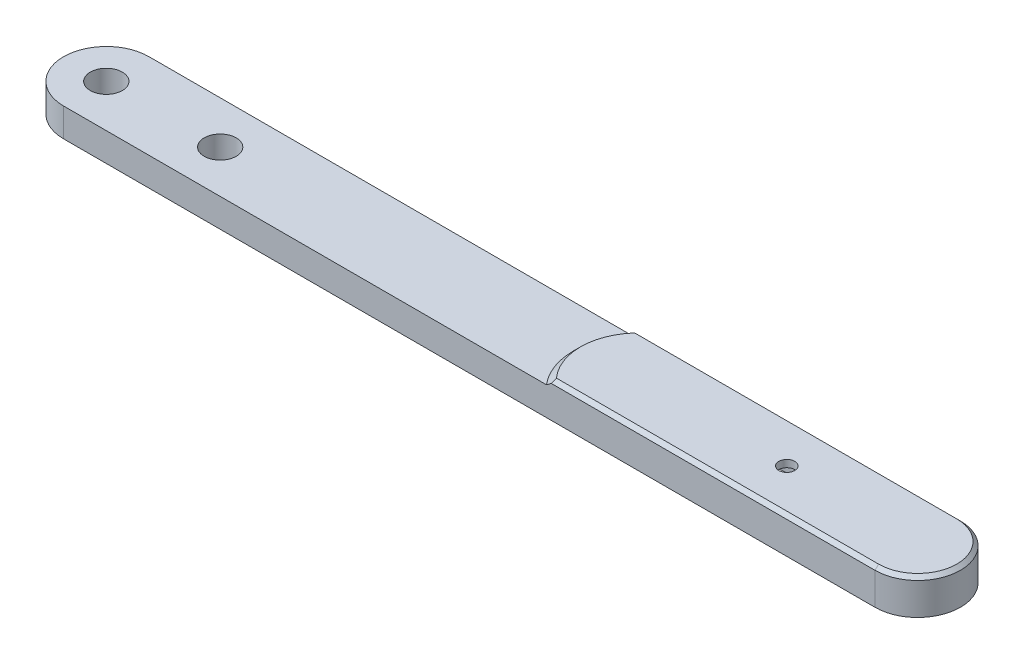
ISO-10303-21;
HEADER;
FILE_DESCRIPTION(('STEP AP214'),'2;1');
FILE_NAME('part.step','',(''),(''),'','','');
FILE_SCHEMA(('AUTOMOTIVE_DESIGN { 1 0 10303 214 1 1 1 1 }'));
ENDSEC;
DATA;
#1=APPLICATION_CONTEXT('core data for automotive mechanical design processes');
#2=APPLICATION_PROTOCOL_DEFINITION('international standard','automotive_design',2000,#1);
#3=PRODUCT_CONTEXT('',#1,'mechanical');
#4=PRODUCT('Part','Part','',(#3));
#5=PRODUCT_RELATED_PRODUCT_CATEGORY('part','',(#4));
#6=PRODUCT_DEFINITION_FORMATION('','',#4);
#7=PRODUCT_DEFINITION_CONTEXT('part definition',#1,'design');
#8=PRODUCT_DEFINITION('design','',#6,#7);
#9=PRODUCT_DEFINITION_SHAPE('','',#8);
#10=(LENGTH_UNIT() NAMED_UNIT(*) SI_UNIT(.MILLI.,.METRE.));
#11=(NAMED_UNIT(*) PLANE_ANGLE_UNIT() SI_UNIT($,.RADIAN.));
#12=(NAMED_UNIT(*) SI_UNIT($,.STERADIAN.) SOLID_ANGLE_UNIT());
#13=UNCERTAINTY_MEASURE_WITH_UNIT(LENGTH_MEASURE(1.E-05),#10,'distance_accuracy_value','');
#14=(GEOMETRIC_REPRESENTATION_CONTEXT(3) GLOBAL_UNCERTAINTY_ASSIGNED_CONTEXT((#13)) GLOBAL_UNIT_ASSIGNED_CONTEXT((#10,
#11,#12)) REPRESENTATION_CONTEXT('',''));
#15=CARTESIAN_POINT('',(0.,0.,0.));
#16=DIRECTION('',(0.,0.,1.));
#17=DIRECTION('',(1.,0.,0.));
#18=AXIS2_PLACEMENT_3D('',#15,#16,#17);
#19=CARTESIAN_POINT('',(-69.98462472,11.095,-5.9));
#20=DIRECTION('',(0.,1.,0.));
#21=DIRECTION('',(0.,0.,1.));
#22=AXIS2_PLACEMENT_3D('',#19,#20,#21);
#23=CYLINDRICAL_SURFACE('',#22,4.7625);
#24=CARTESIAN_POINT('',(-69.98462472,14.27,-5.9));
#25=DIRECTION('',(0.,1.,0.));
#26=DIRECTION('',(0.,0.,1.));
#27=AXIS2_PLACEMENT_3D('',#24,#25,#26);
#28=CIRCLE('',#27,4.7625);
#29=CARTESIAN_POINT('',(-69.98462472,14.27,-10.6625));
#30=VERTEX_POINT('',#29);
#31=CARTESIAN_POINT('',(-69.98462472,14.27,-1.1375));
#32=VERTEX_POINT('',#31);
#33=EDGE_CURVE('E195',#30,#32,#28,.T.);
#34=ORIENTED_EDGE('',*,*,#33,.F.);
#35=DIRECTION('',(0.,1.,0.));
#36=VECTOR('',#35,1.);
#37=CARTESIAN_POINT('',(-69.98462472,11.095,-10.6625));
#38=LINE('',#37,#36);
#39=CARTESIAN_POINT('',(-69.98462472,11.095,-10.6625));
#40=VERTEX_POINT('',#39);
#41=EDGE_CURVE('E213',#40,#30,#38,.T.);
#42=ORIENTED_EDGE('',*,*,#41,.F.);
#43=CARTESIAN_POINT('',(-69.98462472,11.095,-5.9));
#44=DIRECTION('',(0.,1.,0.));
#45=DIRECTION('',(0.,0.,1.));
#46=AXIS2_PLACEMENT_3D('',#43,#44,#45);
#47=CIRCLE('',#46,4.7625);
#48=CARTESIAN_POINT('',(-69.98462472,11.095,-1.1375));
#49=VERTEX_POINT('',#48);
#50=EDGE_CURVE('E181',#40,#49,#47,.T.);
#51=ORIENTED_EDGE('',*,*,#50,.T.);
#52=DIRECTION('',(0.,1.,0.));
#53=VECTOR('',#52,1.);
#54=CARTESIAN_POINT('',(-69.98462472,11.095,-1.1375));
#55=LINE('',#54,#53);
#56=EDGE_CURVE('E194',#49,#32,#55,.T.);
#57=ORIENTED_EDGE('',*,*,#56,.T.);
#58=EDGE_LOOP('',(#34,#42,#51,#57));
#59=FACE_BOUND('',#58,.T.);
#60=ADVANCED_FACE('F32',(#59),#23,.T.);
#61=CARTESIAN_POINT('',(20.5,11.095,-10.6625));
#62=DIRECTION('',(0.,0.,-1.));
#63=DIRECTION('',(-1.,0.,0.));
#64=AXIS2_PLACEMENT_3D('',#61,#62,#63);
#65=PLANE('',#64);
#66=CARTESIAN_POINT('',(-16.1358016582967,14.27,-10.6625));
#67=CARTESIAN_POINT('',(-16.0450029038725,14.3388277477596,-10.6625));
#68=CARTESIAN_POINT('',(-15.9538599768672,14.4072041000675,-10.6625));
#69=CARTESIAN_POINT('',(-15.7708252611896,14.5429156845768,-10.6625));
#70=CARTESIAN_POINT('',(-15.6789335948947,14.6102510819034,-10.6625));
#71=CARTESIAN_POINT('',(-15.494309265144,14.7437664242642,-10.6625));
#72=CARTESIAN_POINT('',(-15.4015765784473,14.809946337219,-10.6625));
#73=CARTESIAN_POINT('',(-15.2151695542577,14.9409977912461,-10.6625));
#74=CARTESIAN_POINT('',(-15.121495068085,15.0058691207168,-10.6625));
#75=CARTESIAN_POINT('',(-15.0273129548294,15.07,-10.6625));
#76=B_SPLINE_CURVE_WITH_KNOTS('',3,(#66,#67,#68,#69,#70,#71,#72,#73,#74,#75),.UNSPECIFIED.,.F.,
.F.,(4,2,2,2,4),(0.,0.341812299406749,0.683569809434601,1.02533679259764,1.36715860448552),.UNSPECIFIED.);
#77=CARTESIAN_POINT('',(-16.1358016582967,14.27,-10.6625));
#78=VERTEX_POINT('',#77);
#79=CARTESIAN_POINT('',(-15.5963086373971,14.6699999999907,-10.6625));
#80=VERTEX_POINT('',#79);
#81=EDGE_CURVE('E223',#78,#80,#76,.T.);
#82=ORIENTED_EDGE('',*,*,#81,.T.);
#83=DIRECTION('',(1.,0.,0.));
#84=VECTOR('',#83,1.);
#85=CARTESIAN_POINT('',(20.5,14.67,-10.6625));
#86=LINE('',#85,#84);
#87=CARTESIAN_POINT('',(20.5,14.67,-10.6625));
#88=VERTEX_POINT('',#87);
#89=EDGE_CURVE('E57',#80,#88,#86,.T.);
#90=ORIENTED_EDGE('',*,*,#89,.T.);
#91=DIRECTION('',(0.,1.,0.));
#92=VECTOR('',#91,1.);
#93=CARTESIAN_POINT('',(20.5,11.095,-10.6625));
#94=LINE('',#93,#92);
#95=CARTESIAN_POINT('',(20.5,11.095,-10.6625));
#96=VERTEX_POINT('',#95);
#97=EDGE_CURVE('E255',#96,#88,#94,.T.);
#98=ORIENTED_EDGE('',*,*,#97,.F.);
#99=DIRECTION('',(-1.,0.,0.));
#100=VECTOR('',#99,1.);
#101=CARTESIAN_POINT('',(20.5,11.095,-10.6625));
#102=LINE('',#101,#100);
#103=EDGE_CURVE('E191',#96,#40,#102,.T.);
#104=ORIENTED_EDGE('',*,*,#103,.T.);
#105=ORIENTED_EDGE('',*,*,#41,.T.);
#106=DIRECTION('',(-1.,0.,0.));
#107=VECTOR('',#106,1.);
#108=CARTESIAN_POINT('',(20.5,14.27,-10.6625));
#109=LINE('',#108,#107);
#110=EDGE_CURVE('E185',#78,#30,#109,.T.);
#111=ORIENTED_EDGE('',*,*,#110,.F.);
#112=EDGE_LOOP('',(#82,#90,#98,#104,#105,#111));
#113=FACE_BOUND('',#112,.T.);
#114=ADVANCED_FACE('F241',(#113),#65,.T.);
#115=CARTESIAN_POINT('',(20.5,11.095,-5.9));
#116=DIRECTION('',(0.,1.,0.));
#117=DIRECTION('',(0.,0.,1.));
#118=AXIS2_PLACEMENT_3D('',#115,#116,#117);
#119=CYLINDRICAL_SURFACE('',#118,4.7625);
#120=ORIENTED_EDGE('',*,*,#97,.T.);
#121=CARTESIAN_POINT('',(20.5,14.67,-5.9));
#122=DIRECTION('',(0.,1.,0.));
#123=DIRECTION('',(0.,0.,1.));
#124=AXIS2_PLACEMENT_3D('',#121,#122,#123);
#125=CIRCLE('',#124,4.7625);
#126=CARTESIAN_POINT('',(20.5,14.67,-1.1375));
#127=VERTEX_POINT('',#126);
#128=EDGE_CURVE('E42',#88,#127,#125,.F.);
#129=ORIENTED_EDGE('',*,*,#128,.T.);
#130=DIRECTION('',(0.,1.,0.));
#131=VECTOR('',#130,1.);
#132=CARTESIAN_POINT('',(20.5,11.095,-1.1375));
#133=LINE('',#132,#131);
#134=CARTESIAN_POINT('',(20.5,11.095,-1.1375));
#135=VERTEX_POINT('',#134);
#136=EDGE_CURVE('E256',#135,#127,#133,.T.);
#137=ORIENTED_EDGE('',*,*,#136,.F.);
#138=CARTESIAN_POINT('',(20.5,11.095,-5.9));
#139=DIRECTION('',(0.,1.,0.));
#140=DIRECTION('',(0.,0.,1.));
#141=AXIS2_PLACEMENT_3D('',#138,#139,#140);
#142=CIRCLE('',#141,4.7625);
#143=EDGE_CURVE('E188',#135,#96,#142,.T.);
#144=ORIENTED_EDGE('',*,*,#143,.T.);
#145=EDGE_LOOP('',(#120,#129,#137,#144));
#146=FACE_BOUND('',#145,.T.);
#147=ADVANCED_FACE('F238',(#146),#119,.T.);
#148=CARTESIAN_POINT('',(-69.98462472,11.095,-1.1375));
#149=DIRECTION('',(0.,0.,1.));
#150=DIRECTION('',(1.,0.,0.));
#151=AXIS2_PLACEMENT_3D('',#148,#149,#150);
#152=PLANE('',#151);
#153=ORIENTED_EDGE('',*,*,#136,.T.);
#154=DIRECTION('',(-1.,0.,0.));
#155=VECTOR('',#154,1.);
#156=CARTESIAN_POINT('',(-69.98462472,14.67,-1.1375));
#157=LINE('',#156,#155);
#158=CARTESIAN_POINT('',(-15.5963086373843,14.67,-1.1375));
#159=VERTEX_POINT('',#158);
#160=EDGE_CURVE('E11',#127,#159,#157,.T.);
#161=ORIENTED_EDGE('',*,*,#160,.T.);
#162=CARTESIAN_POINT('',(-15.0273129548294,15.07,-1.1375));
#163=CARTESIAN_POINT('',(-15.121495068085,15.0058691207168,-1.1375));
#164=CARTESIAN_POINT('',(-15.2151695542577,14.9409977912461,-1.1375));
#165=CARTESIAN_POINT('',(-15.4015765784473,14.809946337219,-1.1375));
#166=CARTESIAN_POINT('',(-15.494309265144,14.7437664242642,-1.1375));
#167=CARTESIAN_POINT('',(-15.6789335948947,14.6102510819034,-1.1375));
#168=CARTESIAN_POINT('',(-15.7708252611896,14.5429156845768,-1.1375));
#169=CARTESIAN_POINT('',(-15.9538599768672,14.4072041000675,-1.1375));
#170=CARTESIAN_POINT('',(-16.0450029038725,14.3388277477596,-1.1375));
#171=CARTESIAN_POINT('',(-16.1358016582967,14.27,-1.1375));
#172=B_SPLINE_CURVE_WITH_KNOTS('',3,(#162,#163,#164,#165,#166,#167,#168,#169,#170,#171),
.UNSPECIFIED.,.F.,.F.,(4,2,2,2,4),(0.,0.341821811887878,0.683588795050915,1.02534630507877,
1.36715860448552),.UNSPECIFIED.);
#173=CARTESIAN_POINT('',(-16.1358016582967,14.27,-1.1375));
#174=VERTEX_POINT('',#173);
#175=EDGE_CURVE('E216',#159,#174,#172,.T.);
#176=ORIENTED_EDGE('',*,*,#175,.T.);
#177=DIRECTION('',(1.,0.,0.));
#178=VECTOR('',#177,1.);
#179=CARTESIAN_POINT('',(-69.98462472,14.27,-1.1375));
#180=LINE('',#179,#178);
#181=EDGE_CURVE('E198',#32,#174,#180,.T.);
#182=ORIENTED_EDGE('',*,*,#181,.F.);
#183=ORIENTED_EDGE('',*,*,#56,.F.);
#184=DIRECTION('',(1.,0.,0.));
#185=VECTOR('',#184,1.);
#186=CARTESIAN_POINT('',(-69.98462472,11.095,-1.1375));
#187=LINE('',#186,#185);
#188=EDGE_CURVE('E184',#49,#135,#187,.T.);
#189=ORIENTED_EDGE('',*,*,#188,.T.);
#190=EDGE_LOOP('',(#153,#161,#176,#182,#183,#189));
#191=FACE_BOUND('',#190,.T.);
#192=ADVANCED_FACE('F233',(#191),#152,.T.);
#193=CARTESIAN_POINT('',(-69.98462472,11.095,-5.9));
#194=DIRECTION('',(0.,1.,0.));
#195=DIRECTION('',(0.,0.,1.));
#196=AXIS2_PLACEMENT_3D('',#193,#194,#195);
#197=PLANE('',#196);
#198=CARTESIAN_POINT('',(-69.98462472,11.095,-5.9));
#199=DIRECTION('',(0.,1.,0.));
#200=DIRECTION('',(0.,0.,1.));
#201=AXIS2_PLACEMENT_3D('',#198,#199,#200);
#202=CIRCLE('',#201,1.786001);
#203=CARTESIAN_POINT('',(-69.98462472,11.095,-4.11399900000001));
#204=VERTEX_POINT('',#203);
#205=EDGE_CURVE('E277',#204,#204,#202,.T.);
#206=ORIENTED_EDGE('',*,*,#205,.T.);
#207=EDGE_LOOP('',(#206));
#208=FACE_BOUND('',#207,.T.);
#209=CARTESIAN_POINT('',(-57.28462472,11.095,-5.9));
#210=DIRECTION('',(0.,1.,0.));
#211=DIRECTION('',(0.,0.,1.));
#212=AXIS2_PLACEMENT_3D('',#209,#210,#211);
#213=CIRCLE('',#212,1.786001);
#214=CARTESIAN_POINT('',(-57.28462472,11.095,-4.113999));
#215=VERTEX_POINT('',#214);
#216=EDGE_CURVE('E368',#215,#215,#213,.T.);
#217=ORIENTED_EDGE('',*,*,#216,.T.);
#218=EDGE_LOOP('',(#217));
#219=FACE_BOUND('',#218,.T.);
#220=DIRECTION('',(-0.997325531387097,0.,-0.0730875122264069));
#221=VECTOR('',#220,1.);
#222=CARTESIAN_POINT('',(20.082718780566,11.095,-8.39331382846774));
#223=LINE('',#222,#221);
#224=CARTESIAN_POINT('',(20.082718780566,11.095,-8.39331382846774));
#225=VERTEX_POINT('',#224);
#226=CARTESIAN_POINT('',(8.20949574631605,11.095,-9.26342524783115));
#227=VERTEX_POINT('',#226);
#228=EDGE_CURVE('E172',#225,#227,#223,.T.);
#229=ORIENTED_EDGE('',*,*,#228,.T.);
#230=CARTESIAN_POINT('',(5.9,11.095,-5.9));
#231=DIRECTION('',(0.,1.,0.));
#232=DIRECTION('',(0.,0.,1.));
#233=AXIS2_PLACEMENT_3D('',#230,#231,#232);
#234=CIRCLE('',#233,4.08);
#235=CARTESIAN_POINT('',(3.59050425368395,11.095,-9.26342524783115));
#236=VERTEX_POINT('',#235);
#237=EDGE_CURVE('E378',#227,#236,#234,.T.);
#238=ORIENTED_EDGE('',*,*,#237,.T.);
#239=DIRECTION('',(-0.997325531387097,0.,0.0730875122264062));
#240=VECTOR('',#239,1.);
#241=CARTESIAN_POINT('',(3.59050425368395,11.095,-9.26342524783115));
#242=LINE('',#241,#240);
#243=CARTESIAN_POINT('',(-8.282718780566,11.095,-8.39331382846775));
#244=VERTEX_POINT('',#243);
#245=EDGE_CURVE('E169',#236,#244,#242,.T.);
#246=ORIENTED_EDGE('',*,*,#245,.T.);
#247=CARTESIAN_POINT('',(-8.09999999999999,11.095,-5.9));
#248=DIRECTION('',(0.,1.,0.));
#249=DIRECTION('',(0.,0.,1.));
#250=AXIS2_PLACEMENT_3D('',#247,#248,#249);
#251=CIRCLE('',#250,2.5);
#252=CARTESIAN_POINT('',(-8.28271878056601,11.095,-3.40668617153226));
#253=VERTEX_POINT('',#252);
#254=EDGE_CURVE('E382',#244,#253,#251,.T.);
#255=ORIENTED_EDGE('',*,*,#254,.T.);
#256=DIRECTION('',(0.997325531387097,0.,0.0730875122264068));
#257=VECTOR('',#256,1.);
#258=CARTESIAN_POINT('',(-8.28271878056601,11.095,-3.40668617153226));
#259=LINE('',#258,#257);
#260=CARTESIAN_POINT('',(3.59050425368395,11.095,-2.53657475216885));
#261=VERTEX_POINT('',#260);
#262=EDGE_CURVE('E385',#253,#261,#259,.T.);
#263=ORIENTED_EDGE('',*,*,#262,.T.);
#264=CARTESIAN_POINT('',(5.9,11.095,-5.9));
#265=DIRECTION('',(0.,1.,0.));
#266=DIRECTION('',(0.,0.,1.));
#267=AXIS2_PLACEMENT_3D('',#264,#265,#266);
#268=CIRCLE('',#267,4.08);
#269=CARTESIAN_POINT('',(8.20949574631605,11.095,-2.53657475216885));
#270=VERTEX_POINT('',#269);
#271=EDGE_CURVE('E388',#261,#270,#268,.T.);
#272=ORIENTED_EDGE('',*,*,#271,.T.);
#273=DIRECTION('',(0.997325531387097,0.,-0.0730875122264064));
#274=VECTOR('',#273,1.);
#275=CARTESIAN_POINT('',(8.20949574631605,11.095,-2.53657475216885));
#276=LINE('',#275,#274);
#277=CARTESIAN_POINT('',(20.082718780566,11.095,-3.40668617153226));
#278=VERTEX_POINT('',#277);
#279=EDGE_CURVE('E391',#270,#278,#276,.T.);
#280=ORIENTED_EDGE('',*,*,#279,.T.);
#281=CARTESIAN_POINT('',(19.9,11.095,-5.9));
#282=DIRECTION('',(0.,1.,0.));
#283=DIRECTION('',(0.,0.,1.));
#284=AXIS2_PLACEMENT_3D('',#281,#282,#283);
#285=CIRCLE('',#284,2.5);
#286=EDGE_CURVE('E177',#278,#225,#285,.T.);
#287=ORIENTED_EDGE('',*,*,#286,.T.);
#288=EDGE_LOOP('',(#229,#238,#246,#255,#263,#272,#280,#287));
#289=FACE_BOUND('',#288,.T.);
#290=ORIENTED_EDGE('',*,*,#50,.F.);
#291=ORIENTED_EDGE('',*,*,#103,.F.);
#292=ORIENTED_EDGE('',*,*,#143,.F.);
#293=ORIENTED_EDGE('',*,*,#188,.F.);
#294=EDGE_LOOP('',(#290,#291,#292,#293));
#295=FACE_BOUND('',#294,.T.);
#296=ADVANCED_FACE('F237',(#208,#219,#289,#295),#197,.F.);
#297=CARTESIAN_POINT('',(-69.98462472,14.27,-5.9));
#298=DIRECTION('',(0.,1.,0.));
#299=DIRECTION('',(0.,0.,1.));
#300=AXIS2_PLACEMENT_3D('',#297,#298,#299);
#301=PLANE('',#300);
#302=CARTESIAN_POINT('',(-69.98462472,14.27,-5.9));
#303=DIRECTION('',(0.,1.,0.));
#304=DIRECTION('',(0.,0.,1.));
#305=AXIS2_PLACEMENT_3D('',#302,#303,#304);
#306=CIRCLE('',#305,1.786001);
#307=CARTESIAN_POINT('',(-69.98462472,14.27,-4.11399900000001));
#308=VERTEX_POINT('',#307);
#309=EDGE_CURVE('E274',#308,#308,#306,.T.);
#310=ORIENTED_EDGE('',*,*,#309,.F.);
#311=EDGE_LOOP('',(#310));
#312=FACE_BOUND('',#311,.T.);
#313=CARTESIAN_POINT('',(-57.28462472,14.27,-5.9));
#314=DIRECTION('',(0.,1.,0.));
#315=DIRECTION('',(0.,0.,1.));
#316=AXIS2_PLACEMENT_3D('',#313,#314,#315);
#317=CIRCLE('',#316,1.786001);
#318=CARTESIAN_POINT('',(-57.28462472,14.27,-4.11399900000001));
#319=VERTEX_POINT('',#318);
#320=EDGE_CURVE('E366',#319,#319,#317,.T.);
#321=ORIENTED_EDGE('',*,*,#320,.F.);
#322=EDGE_LOOP('',(#321));
#323=FACE_BOUND('',#322,.T.);
#324=ORIENTED_EDGE('',*,*,#181,.T.);
#325=CARTESIAN_POINT('',(-10.6,14.27,-5.9));
#326=DIRECTION('',(0.,1.,0.));
#327=DIRECTION('',(0.,0.,1.));
#328=AXIS2_PLACEMENT_3D('',#325,#326,#327);
#329=CIRCLE('',#328,7.30250000000002);
#330=EDGE_CURVE('E209',#174,#78,#329,.F.);
#331=ORIENTED_EDGE('',*,*,#330,.T.);
#332=ORIENTED_EDGE('',*,*,#110,.T.);
#333=ORIENTED_EDGE('',*,*,#33,.T.);
#334=EDGE_LOOP('',(#324,#331,#332,#333));
#335=FACE_BOUND('',#334,.T.);
#336=ADVANCED_FACE('F251',(#312,#323,#335),#301,.T.);
#337=CARTESIAN_POINT('',(5.9,11.095,-5.9));
#338=DIRECTION('',(0.,1.,0.));
#339=DIRECTION('',(0.,0.,1.));
#340=AXIS2_PLACEMENT_3D('',#337,#338,#339);
#341=CYLINDRICAL_SURFACE('',#340,4.08);
#342=CARTESIAN_POINT('',(5.9,14.27,-5.9));
#343=DIRECTION('',(0.,1.,0.));
#344=DIRECTION('',(0.,0.,1.));
#345=AXIS2_PLACEMENT_3D('',#342,#343,#344);
#346=CIRCLE('',#345,4.08);
#347=CARTESIAN_POINT('',(8.20949574631605,14.27,-9.26342524783115));
#348=VERTEX_POINT('',#347);
#349=CARTESIAN_POINT('',(3.59050425368396,14.27,-9.26342524783115));
#350=VERTEX_POINT('',#349);
#351=EDGE_CURVE('E149',#348,#350,#346,.T.);
#352=ORIENTED_EDGE('',*,*,#351,.T.);
#353=DIRECTION('',(0.,1.,0.));
#354=VECTOR('',#353,1.);
#355=CARTESIAN_POINT('',(3.59050425368395,11.095,-9.26342524783115));
#356=LINE('',#355,#354);
#357=EDGE_CURVE('E161',#236,#350,#356,.T.);
#358=ORIENTED_EDGE('',*,*,#357,.F.);
#359=ORIENTED_EDGE('',*,*,#237,.F.);
#360=DIRECTION('',(0.,1.,0.));
#361=VECTOR('',#360,1.);
#362=CARTESIAN_POINT('',(8.20949574631605,11.095,-9.26342524783115));
#363=LINE('',#362,#361);
#364=EDGE_CURVE('E163',#227,#348,#363,.T.);
#365=ORIENTED_EDGE('',*,*,#364,.T.);
#366=EDGE_LOOP('',(#352,#358,#359,#365));
#367=FACE_BOUND('',#366,.T.);
#368=ADVANCED_FACE('F159',(#367),#341,.F.);
#369=CARTESIAN_POINT('',(20.082718780566,11.095,-8.39331382846774));
#370=DIRECTION('',(0.0730875122264068,0.,-0.997325531387097));
#371=DIRECTION('',(-0.997325531387097,0.,-0.0730875122264069));
#372=AXIS2_PLACEMENT_3D('',#369,#370,#371);
#373=PLANE('',#372);
#374=DIRECTION('',(-0.997325531387097,0.,-0.0730875122264069));
#375=VECTOR('',#374,1.);
#376=CARTESIAN_POINT('',(20.082718780566,14.27,-8.39331382846774));
#377=LINE('',#376,#375);
#378=CARTESIAN_POINT('',(20.082718780566,14.27,-8.39331382846774));
#379=VERTEX_POINT('',#378);
#380=EDGE_CURVE('E380',#379,#348,#377,.T.);
#381=ORIENTED_EDGE('',*,*,#380,.T.);
#382=ORIENTED_EDGE('',*,*,#364,.F.);
#383=ORIENTED_EDGE('',*,*,#228,.F.);
#384=DIRECTION('',(0.,1.,0.));
#385=VECTOR('',#384,1.);
#386=CARTESIAN_POINT('',(20.082718780566,11.095,-8.39331382846774));
#387=LINE('',#386,#385);
#388=EDGE_CURVE('E411',#225,#379,#387,.T.);
#389=ORIENTED_EDGE('',*,*,#388,.T.);
#390=EDGE_LOOP('',(#381,#382,#383,#389));
#391=FACE_BOUND('',#390,.T.);
#392=ADVANCED_FACE('F326',(#391),#373,.F.);
#393=CARTESIAN_POINT('',(19.9,11.095,-5.9));
#394=DIRECTION('',(0.,1.,0.));
#395=DIRECTION('',(0.,0.,1.));
#396=AXIS2_PLACEMENT_3D('',#393,#394,#395);
#397=CYLINDRICAL_SURFACE('',#396,2.5);
#398=CARTESIAN_POINT('',(19.9,14.27,-5.9));
#399=DIRECTION('',(0.,1.,0.));
#400=DIRECTION('',(0.,0.,1.));
#401=AXIS2_PLACEMENT_3D('',#398,#399,#400);
#402=CIRCLE('',#401,2.5);
#403=CARTESIAN_POINT('',(20.082718780566,14.27,-3.40668617153226));
#404=VERTEX_POINT('',#403);
#405=EDGE_CURVE('E406',#404,#379,#402,.T.);
#406=ORIENTED_EDGE('',*,*,#405,.T.);
#407=ORIENTED_EDGE('',*,*,#388,.F.);
#408=ORIENTED_EDGE('',*,*,#286,.F.);
#409=DIRECTION('',(0.,1.,0.));
#410=VECTOR('',#409,1.);
#411=CARTESIAN_POINT('',(20.082718780566,11.095,-3.40668617153226));
#412=LINE('',#411,#410);
#413=EDGE_CURVE('E414',#278,#404,#412,.T.);
#414=ORIENTED_EDGE('',*,*,#413,.T.);
#415=EDGE_LOOP('',(#406,#407,#408,#414));
#416=FACE_BOUND('',#415,.T.);
#417=ADVANCED_FACE('F329',(#416),#397,.F.);
#418=CARTESIAN_POINT('',(8.20949574631605,11.095,-2.53657475216885));
#419=DIRECTION('',(0.0730875122264064,0.,0.997325531387097));
#420=DIRECTION('',(0.997325531387097,0.,-0.0730875122264064));
#421=AXIS2_PLACEMENT_3D('',#418,#419,#420);
#422=PLANE('',#421);
#423=DIRECTION('',(0.997325531387097,0.,-0.0730875122264064));
#424=VECTOR('',#423,1.);
#425=CARTESIAN_POINT('',(8.20949574631605,14.27,-2.53657475216885));
#426=LINE('',#425,#424);
#427=CARTESIAN_POINT('',(8.20949574631605,14.27,-2.53657475216885));
#428=VERTEX_POINT('',#427);
#429=EDGE_CURVE('E403',#428,#404,#426,.T.);
#430=ORIENTED_EDGE('',*,*,#429,.T.);
#431=ORIENTED_EDGE('',*,*,#413,.F.);
#432=ORIENTED_EDGE('',*,*,#279,.F.);
#433=DIRECTION('',(0.,1.,0.));
#434=VECTOR('',#433,1.);
#435=CARTESIAN_POINT('',(8.20949574631605,11.095,-2.53657475216885));
#436=LINE('',#435,#434);
#437=EDGE_CURVE('E417',#270,#428,#436,.T.);
#438=ORIENTED_EDGE('',*,*,#437,.T.);
#439=EDGE_LOOP('',(#430,#431,#432,#438));
#440=FACE_BOUND('',#439,.T.);
#441=ADVANCED_FACE('F333',(#440),#422,.F.);
#442=CARTESIAN_POINT('',(5.9,11.095,-5.9));
#443=DIRECTION('',(0.,1.,0.));
#444=DIRECTION('',(0.,0.,1.));
#445=AXIS2_PLACEMENT_3D('',#442,#443,#444);
#446=CYLINDRICAL_SURFACE('',#445,4.08);
#447=CARTESIAN_POINT('',(5.9,14.27,-5.9));
#448=DIRECTION('',(0.,1.,0.));
#449=DIRECTION('',(0.,0.,1.));
#450=AXIS2_PLACEMENT_3D('',#447,#448,#449);
#451=CIRCLE('',#450,4.08);
#452=CARTESIAN_POINT('',(3.59050425368395,14.27,-2.53657475216885));
#453=VERTEX_POINT('',#452);
#454=EDGE_CURVE('E400',#453,#428,#451,.T.);
#455=ORIENTED_EDGE('',*,*,#454,.T.);
#456=ORIENTED_EDGE('',*,*,#437,.F.);
#457=ORIENTED_EDGE('',*,*,#271,.F.);
#458=DIRECTION('',(0.,1.,0.));
#459=VECTOR('',#458,1.);
#460=CARTESIAN_POINT('',(3.59050425368395,11.095,-2.53657475216885));
#461=LINE('',#460,#459);
#462=EDGE_CURVE('E420',#261,#453,#461,.T.);
#463=ORIENTED_EDGE('',*,*,#462,.T.);
#464=EDGE_LOOP('',(#455,#456,#457,#463));
#465=FACE_BOUND('',#464,.T.);
#466=ADVANCED_FACE('F337',(#465),#446,.F.);
#467=CARTESIAN_POINT('',(-8.28271878056601,11.095,-3.40668617153226));
#468=DIRECTION('',(-0.0730875122264068,0.,0.997325531387097));
#469=DIRECTION('',(0.997325531387097,0.,0.0730875122264068));
#470=AXIS2_PLACEMENT_3D('',#467,#468,#469);
#471=PLANE('',#470);
#472=DIRECTION('',(0.997325531387097,0.,0.0730875122264068));
#473=VECTOR('',#472,1.);
#474=CARTESIAN_POINT('',(-8.28271878056601,14.27,-3.40668617153226));
#475=LINE('',#474,#473);
#476=CARTESIAN_POINT('',(-8.28271878056601,14.27,-3.40668617153226));
#477=VERTEX_POINT('',#476);
#478=EDGE_CURVE('E397',#477,#453,#475,.T.);
#479=ORIENTED_EDGE('',*,*,#478,.T.);
#480=ORIENTED_EDGE('',*,*,#462,.F.);
#481=ORIENTED_EDGE('',*,*,#262,.F.);
#482=DIRECTION('',(0.,1.,0.));
#483=VECTOR('',#482,1.);
#484=CARTESIAN_POINT('',(-8.28271878056601,11.095,-3.40668617153226));
#485=LINE('',#484,#483);
#486=EDGE_CURVE('E174',#253,#477,#485,.T.);
#487=ORIENTED_EDGE('',*,*,#486,.T.);
#488=EDGE_LOOP('',(#479,#480,#481,#487));
#489=FACE_BOUND('',#488,.T.);
#490=ADVANCED_FACE('F341',(#489),#471,.F.);
#491=CARTESIAN_POINT('',(-8.09999999999999,11.095,-5.9));
#492=DIRECTION('',(0.,1.,0.));
#493=DIRECTION('',(0.,0.,1.));
#494=AXIS2_PLACEMENT_3D('',#491,#492,#493);
#495=CYLINDRICAL_SURFACE('',#494,2.5);
#496=CARTESIAN_POINT('',(-8.09999999999999,14.27,-5.9));
#497=DIRECTION('',(0.,1.,0.));
#498=DIRECTION('',(0.,0.,1.));
#499=AXIS2_PLACEMENT_3D('',#496,#497,#498);
#500=CIRCLE('',#499,2.5);
#501=CARTESIAN_POINT('',(-8.28271878056601,14.27,-8.39331382846774));
#502=VERTEX_POINT('',#501);
#503=EDGE_CURVE('E152',#502,#477,#500,.T.);
#504=ORIENTED_EDGE('',*,*,#503,.T.);
#505=ORIENTED_EDGE('',*,*,#486,.F.);
#506=ORIENTED_EDGE('',*,*,#254,.F.);
#507=DIRECTION('',(0.,1.,0.));
#508=VECTOR('',#507,1.);
#509=CARTESIAN_POINT('',(-8.28271878056601,11.095,-8.39331382846774));
#510=LINE('',#509,#508);
#511=EDGE_CURVE('E171',#244,#502,#510,.T.);
#512=ORIENTED_EDGE('',*,*,#511,.T.);
#513=EDGE_LOOP('',(#504,#505,#506,#512));
#514=FACE_BOUND('',#513,.T.);
#515=ADVANCED_FACE('F345',(#514),#495,.F.);
#516=CARTESIAN_POINT('',(3.59050425368395,11.095,-9.26342524783115));
#517=DIRECTION('',(-0.0730875122264063,0.,-0.997325531387097));
#518=DIRECTION('',(-0.997325531387097,0.,0.0730875122264063));
#519=AXIS2_PLACEMENT_3D('',#516,#517,#518);
#520=PLANE('',#519);
#521=DIRECTION('',(-0.997325531387097,0.,0.0730875122264062));
#522=VECTOR('',#521,1.);
#523=CARTESIAN_POINT('',(3.59050425368395,14.27,-9.26342524783115));
#524=LINE('',#523,#522);
#525=EDGE_CURVE('E146',#350,#502,#524,.T.);
#526=ORIENTED_EDGE('',*,*,#525,.T.);
#527=ORIENTED_EDGE('',*,*,#511,.F.);
#528=ORIENTED_EDGE('',*,*,#245,.F.);
#529=ORIENTED_EDGE('',*,*,#357,.T.);
#530=EDGE_LOOP('',(#526,#527,#528,#529));
#531=FACE_BOUND('',#530,.T.);
#532=ADVANCED_FACE('F167',(#531),#520,.F.);
#533=CARTESIAN_POINT('',(20.5,15.07,-5.9));
#534=DIRECTION('',(0.,1.,0.));
#535=DIRECTION('',(0.,0.,1.));
#536=AXIS2_PLACEMENT_3D('',#533,#534,#535);
#537=PLANE('',#536);
#538=CARTESIAN_POINT('',(5.9,15.07,-5.9));
#539=DIRECTION('',(0.,1.,0.));
#540=DIRECTION('',(0.,0.,1.));
#541=AXIS2_PLACEMENT_3D('',#538,#539,#540);
#542=CIRCLE('',#541,0.889);
#543=CARTESIAN_POINT('',(5.9,15.07,-5.011));
#544=VERTEX_POINT('',#543);
#545=EDGE_CURVE('E371',#544,#544,#542,.T.);
#546=ORIENTED_EDGE('',*,*,#545,.F.);
#547=EDGE_LOOP('',(#546));
#548=FACE_BOUND('',#547,.T.);
#549=CARTESIAN_POINT('',(20.5,15.07,-5.9));
#550=DIRECTION('',(0.,1.,0.));
#551=DIRECTION('',(0.,0.,1.));
#552=AXIS2_PLACEMENT_3D('',#549,#550,#551);
#553=CIRCLE('',#552,4.36249999999999);
#554=CARTESIAN_POINT('',(20.5,15.07,-1.53750000000001));
#555=VERTEX_POINT('',#554);
#556=CARTESIAN_POINT('',(20.5,15.07,-10.2625));
#557=VERTEX_POINT('',#556);
#558=EDGE_CURVE('E273',#555,#557,#553,.T.);
#559=ORIENTED_EDGE('',*,*,#558,.T.);
#560=DIRECTION('',(-1.,0.,0.));
#561=VECTOR('',#560,1.);
#562=CARTESIAN_POINT('',(20.5,15.07,-10.2625));
#563=LINE('',#562,#561);
#564=CARTESIAN_POINT('',(-15.4219394438338,15.07,-10.2625));
#565=VERTEX_POINT('',#564);
#566=EDGE_CURVE('E574',#557,#565,#563,.T.);
#567=ORIENTED_EDGE('',*,*,#566,.T.);
#568=CARTESIAN_POINT('',(-10.6,15.07,-5.9));
#569=DIRECTION('',(0.,1.,0.));
#570=DIRECTION('',(0.,0.,1.));
#571=AXIS2_PLACEMENT_3D('',#568,#569,#570);
#572=CIRCLE('',#571,6.50250000000002);
#573=CARTESIAN_POINT('',(-15.4219394438338,15.07,-1.53750000000001));
#574=VERTEX_POINT('',#573);
#575=EDGE_CURVE('E212',#565,#574,#572,.T.);
#576=ORIENTED_EDGE('',*,*,#575,.T.);
#577=DIRECTION('',(1.,0.,0.));
#578=VECTOR('',#577,1.);
#579=CARTESIAN_POINT('',(20.5,15.07,-1.53750000000001));
#580=LINE('',#579,#578);
#581=EDGE_CURVE('E573',#574,#555,#580,.T.);
#582=ORIENTED_EDGE('',*,*,#581,.T.);
#583=EDGE_LOOP('',(#559,#567,#576,#582));
#584=FACE_BOUND('',#583,.T.);
#585=ADVANCED_FACE('F319',(#548,#584),#537,.T.);
#586=CARTESIAN_POINT('',(20.5,14.27,-5.9));
#587=DIRECTION('',(0.,1.,0.));
#588=DIRECTION('',(0.,0.,1.));
#589=AXIS2_PLACEMENT_3D('',#586,#587,#588);
#590=PLANE('',#589);
#591=CARTESIAN_POINT('',(5.9,14.27,-5.9));
#592=DIRECTION('',(0.,1.,0.));
#593=DIRECTION('',(0.,0.,1.));
#594=AXIS2_PLACEMENT_3D('',#591,#592,#593);
#595=CIRCLE('',#594,0.889);
#596=CARTESIAN_POINT('',(5.9,14.27,-5.011));
#597=VERTEX_POINT('',#596);
#598=EDGE_CURVE('E165',#597,#597,#595,.T.);
#599=ORIENTED_EDGE('',*,*,#598,.T.);
#600=EDGE_LOOP('',(#599));
#601=FACE_BOUND('',#600,.T.);
#602=ORIENTED_EDGE('',*,*,#351,.F.);
#603=ORIENTED_EDGE('',*,*,#380,.F.);
#604=ORIENTED_EDGE('',*,*,#405,.F.);
#605=ORIENTED_EDGE('',*,*,#429,.F.);
#606=ORIENTED_EDGE('',*,*,#454,.F.);
#607=ORIENTED_EDGE('',*,*,#478,.F.);
#608=ORIENTED_EDGE('',*,*,#503,.F.);
#609=ORIENTED_EDGE('',*,*,#525,.F.);
#610=EDGE_LOOP('',(#602,#603,#604,#605,#606,#607,#608,#609));
#611=FACE_BOUND('',#610,.T.);
#612=ADVANCED_FACE('F148',(#601,#611),#590,.F.);
#613=CARTESIAN_POINT('',(-10.6,16.81,-5.9));
#614=DIRECTION('',(0.,-1.,0.));
#615=DIRECTION('',(0.,0.,-1.));
#616=AXIS2_PLACEMENT_3D('',#613,#614,#615);
#617=CONICAL_SURFACE('',#616,4.7625,0.785398163397443);
#618=ORIENTED_EDGE('',*,*,#575,.F.);
#619=CARTESIAN_POINT('',(-15.4219394438338,15.07,-10.2625));
#620=CARTESIAN_POINT('',(-15.4514722907453,15.0034360481664,-10.3290639518336));
#621=CARTESIAN_POINT('',(-15.4807694829957,14.9368207326914,-10.3956792673086));
#622=CARTESIAN_POINT('',(-15.5388925473374,14.8034873993184,-10.5290126006815));
#623=CARTESIAN_POINT('',(-15.5677184196043,14.7367693814588,-10.5957306185412));
#624=CARTESIAN_POINT('',(-15.596308637386,14.669999999996,-10.662500000004));
#625=B_SPLINE_CURVE_WITH_KNOTS('',3,(#619,#620,#621,#622,#623,#624),.UNSPECIFIED.,.F.,.F.,(4,2,
4),(0.,0.295975900824466,0.591951691279928),.UNSPECIFIED.);
#626=EDGE_CURVE('E284',#565,#80,#625,.T.);
#627=ORIENTED_EDGE('',*,*,#626,.T.);
#628=ORIENTED_EDGE('',*,*,#81,.F.);
#629=ORIENTED_EDGE('',*,*,#330,.F.);
#630=ORIENTED_EDGE('',*,*,#175,.F.);
#631=CARTESIAN_POINT('',(-15.5963086373842,14.67,-1.1375));
#632=CARTESIAN_POINT('',(-15.5677184196029,14.7367693814621,-1.20426938146211));
#633=CARTESIAN_POINT('',(-15.5388925473362,14.8034873993211,-1.2709873993211));
#634=CARTESIAN_POINT('',(-15.4807694829952,14.9368207326927,-1.40432073269275));
#635=CARTESIAN_POINT('',(-15.451472290745,15.0034360481671,-1.4709360481671));
#636=CARTESIAN_POINT('',(-15.4219394438338,15.07,-1.53750000000001));
#637=B_SPLINE_CURVE_WITH_KNOTS('',3,(#631,#632,#633,#634,#635,#636),.UNSPECIFIED.,.F.,.F.,(4,2,
4),(0.,0.295975790452524,0.591951691274052),.UNSPECIFIED.);
#638=EDGE_CURVE('E268',#159,#574,#637,.T.);
#639=ORIENTED_EDGE('',*,*,#638,.T.);
#640=EDGE_LOOP('',(#618,#627,#628,#629,#630,#639));
#641=FACE_BOUND('',#640,.T.);
#642=ADVANCED_FACE('F229',(#641),#617,.T.);
#643=CARTESIAN_POINT('',(5.9,11.095,-5.9));
#644=DIRECTION('',(0.,1.,0.));
#645=DIRECTION('',(0.,0.,1.));
#646=AXIS2_PLACEMENT_3D('',#643,#644,#645);
#647=CYLINDRICAL_SURFACE('',#646,0.889);
#648=ORIENTED_EDGE('',*,*,#545,.T.);
#649=EDGE_LOOP('',(#648));
#650=FACE_BOUND('',#649,.T.);
#651=ORIENTED_EDGE('',*,*,#598,.F.);
#652=EDGE_LOOP('',(#651));
#653=FACE_BOUND('',#652,.T.);
#654=ADVANCED_FACE('F310',(#650,#653),#647,.F.);
#655=CARTESIAN_POINT('',(-57.28462472,14.27,-5.9));
#656=DIRECTION('',(0.,1.,0.));
#657=DIRECTION('',(0.,0.,1.));
#658=AXIS2_PLACEMENT_3D('',#655,#656,#657);
#659=CYLINDRICAL_SURFACE('',#658,1.786001);
#660=ORIENTED_EDGE('',*,*,#216,.F.);
#661=EDGE_LOOP('',(#660));
#662=FACE_BOUND('',#661,.T.);
#663=ORIENTED_EDGE('',*,*,#320,.T.);
#664=EDGE_LOOP('',(#663));
#665=FACE_BOUND('',#664,.T.);
#666=ADVANCED_FACE('F304',(#662,#665),#659,.F.);
#667=CARTESIAN_POINT('',(-69.98462472,14.27,-5.9));
#668=DIRECTION('',(0.,1.,0.));
#669=DIRECTION('',(0.,0.,1.));
#670=AXIS2_PLACEMENT_3D('',#667,#668,#669);
#671=CYLINDRICAL_SURFACE('',#670,1.786001);
#672=ORIENTED_EDGE('',*,*,#205,.F.);
#673=EDGE_LOOP('',(#672));
#674=FACE_BOUND('',#673,.T.);
#675=ORIENTED_EDGE('',*,*,#309,.T.);
#676=EDGE_LOOP('',(#675));
#677=FACE_BOUND('',#676,.T.);
#678=ADVANCED_FACE('F300',(#674,#677),#671,.F.);
#679=CARTESIAN_POINT('',(20.5,15.07,-1.53750000000001));
#680=DIRECTION('',(0.,-0.707106781186548,-0.707106781186548));
#681=DIRECTION('',(1.,0.,0.));
#682=AXIS2_PLACEMENT_3D('',#679,#680,#681);
#683=PLANE('',#682);
#684=ORIENTED_EDGE('',*,*,#638,.F.);
#685=ORIENTED_EDGE('',*,*,#160,.F.);
#686=DIRECTION('',(0.,-0.707106781186548,0.707106781186548));
#687=VECTOR('',#686,1.);
#688=CARTESIAN_POINT('',(20.5,15.07,-1.53750000000001));
#689=LINE('',#688,#687);
#690=EDGE_CURVE('E37',#555,#127,#689,.T.);
#691=ORIENTED_EDGE('',*,*,#690,.F.);
#692=ORIENTED_EDGE('',*,*,#581,.F.);
#693=EDGE_LOOP('',(#684,#685,#691,#692));
#694=FACE_BOUND('',#693,.T.);
#695=ADVANCED_FACE('F34',(#694),#683,.F.);
#696=CARTESIAN_POINT('',(20.5,15.07,-5.9));
#697=DIRECTION('',(0.,-1.,0.));
#698=DIRECTION('',(0.,0.,-1.));
#699=AXIS2_PLACEMENT_3D('',#696,#697,#698);
#700=CONICAL_SURFACE('',#699,4.36249999999999,0.785398163397448);
#701=ORIENTED_EDGE('',*,*,#690,.T.);
#702=ORIENTED_EDGE('',*,*,#128,.F.);
#703=DIRECTION('',(0.,-0.707106781186548,-0.707106781186548));
#704=VECTOR('',#703,1.);
#705=CARTESIAN_POINT('',(20.5,15.07,-10.2625));
#706=LINE('',#705,#704);
#707=EDGE_CURVE('E275',#557,#88,#706,.T.);
#708=ORIENTED_EDGE('',*,*,#707,.F.);
#709=ORIENTED_EDGE('',*,*,#558,.F.);
#710=EDGE_LOOP('',(#701,#702,#708,#709));
#711=FACE_BOUND('',#710,.T.);
#712=ADVANCED_FACE('F270',(#711),#700,.T.);
#713=CARTESIAN_POINT('',(20.5,15.07,-10.2625));
#714=DIRECTION('',(0.,-0.707106781186548,0.707106781186548));
#715=DIRECTION('',(-1.,0.,0.));
#716=AXIS2_PLACEMENT_3D('',#713,#714,#715);
#717=PLANE('',#716);
#718=ORIENTED_EDGE('',*,*,#707,.T.);
#719=ORIENTED_EDGE('',*,*,#89,.F.);
#720=ORIENTED_EDGE('',*,*,#626,.F.);
#721=ORIENTED_EDGE('',*,*,#566,.F.);
#722=EDGE_LOOP('',(#718,#719,#720,#721));
#723=FACE_BOUND('',#722,.T.);
#724=ADVANCED_FACE('F293',(#723),#717,.F.);
#725=CLOSED_SHELL('',(#60,#114,#147,#192,#296,#336,#368,#392,#417,#441,#466,#490,#515,#532,#585,
#612,#642,#654,#666,#678,#695,#712,#724));
#726=MANIFOLD_SOLID_BREP('B2',#725);
#727=ADVANCED_BREP_SHAPE_REPRESENTATION('',(#18,#726),#14);
#728=SHAPE_DEFINITION_REPRESENTATION(#9,#727);
ENDSEC;
END-ISO-10303-21;
